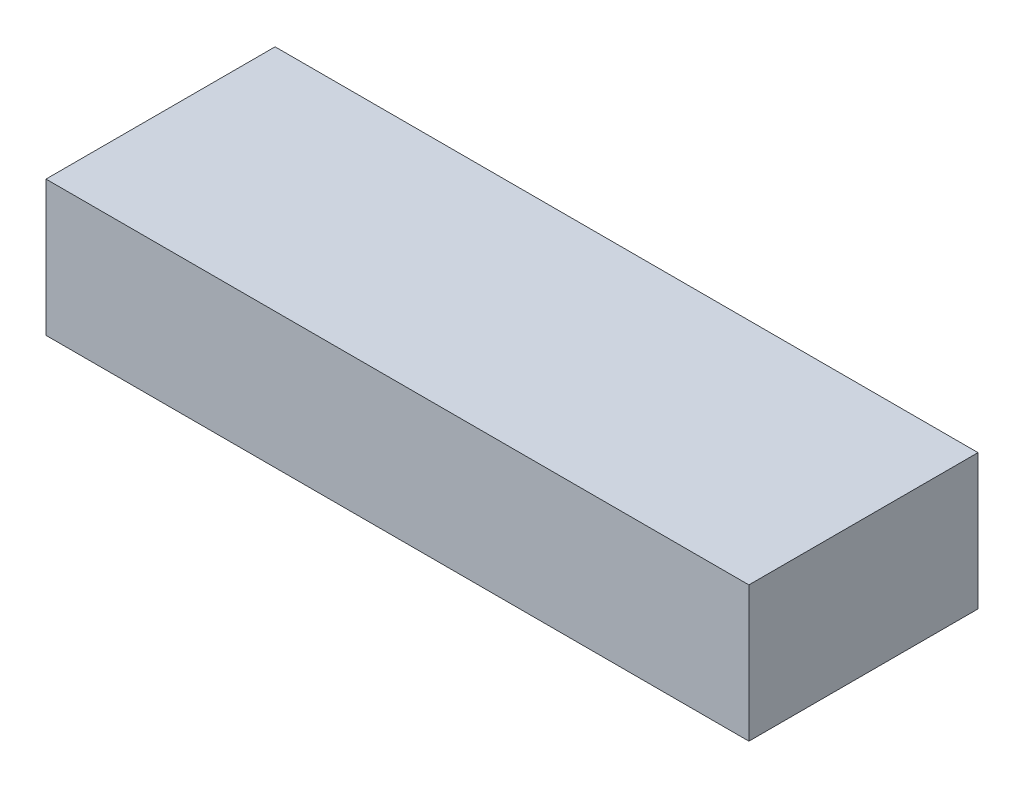
ISO-10303-21;
HEADER;
FILE_DESCRIPTION(('STEP AP214'),'2;1');
FILE_NAME('part.step','',(''),(''),'','','');
FILE_SCHEMA(('AUTOMOTIVE_DESIGN { 1 0 10303 214 1 1 1 1 }'));
ENDSEC;
DATA;
#1=APPLICATION_CONTEXT('core data for automotive mechanical design processes');
#2=APPLICATION_PROTOCOL_DEFINITION('international standard','automotive_design',2000,#1);
#3=PRODUCT_CONTEXT('',#1,'mechanical');
#4=PRODUCT('Part','Part','',(#3));
#5=PRODUCT_RELATED_PRODUCT_CATEGORY('part','',(#4));
#6=PRODUCT_DEFINITION_FORMATION('','',#4);
#7=PRODUCT_DEFINITION_CONTEXT('part definition',#1,'design');
#8=PRODUCT_DEFINITION('design','',#6,#7);
#9=PRODUCT_DEFINITION_SHAPE('','',#8);
#10=(LENGTH_UNIT() NAMED_UNIT(*) SI_UNIT(.MILLI.,.METRE.));
#11=(NAMED_UNIT(*) PLANE_ANGLE_UNIT() SI_UNIT($,.RADIAN.));
#12=(NAMED_UNIT(*) SI_UNIT($,.STERADIAN.) SOLID_ANGLE_UNIT());
#13=UNCERTAINTY_MEASURE_WITH_UNIT(LENGTH_MEASURE(1.E-05),#10,'distance_accuracy_value','');
#14=(GEOMETRIC_REPRESENTATION_CONTEXT(3) GLOBAL_UNCERTAINTY_ASSIGNED_CONTEXT((#13)) GLOBAL_UNIT_ASSIGNED_CONTEXT((#10,
#11,#12)) REPRESENTATION_CONTEXT('',''));
#15=CARTESIAN_POINT('',(0.,0.,0.));
#16=DIRECTION('',(0.,0.,1.));
#17=DIRECTION('',(1.,0.,0.));
#18=AXIS2_PLACEMENT_3D('',#15,#16,#17);
#19=CARTESIAN_POINT('',(0.,26.,0.));
#20=DIRECTION('',(1.,0.,0.));
#21=DIRECTION('',(0.,0.,1.));
#22=AXIS2_PLACEMENT_3D('',#19,#20,#21);
#23=PLANE('',#22);
#24=DIRECTION('',(0.,0.,-1.));
#25=VECTOR('',#24,1.);
#26=CARTESIAN_POINT('',(0.,0.,0.));
#27=LINE('',#26,#25);
#28=CARTESIAN_POINT('',(0.,0.,44.));
#29=VERTEX_POINT('',#28);
#30=CARTESIAN_POINT('',(0.,0.,0.));
#31=VERTEX_POINT('',#30);
#32=EDGE_CURVE('E102',#29,#31,#27,.T.);
#33=ORIENTED_EDGE('',*,*,#32,.F.);
#34=DIRECTION('',(0.,-1.,0.));
#35=VECTOR('',#34,1.);
#36=CARTESIAN_POINT('',(0.,26.,44.));
#37=LINE('',#36,#35);
#38=CARTESIAN_POINT('',(0.,26.,44.));
#39=VERTEX_POINT('',#38);
#40=EDGE_CURVE('E101',#39,#29,#37,.T.);
#41=ORIENTED_EDGE('',*,*,#40,.F.);
#42=DIRECTION('',(0.,0.,-1.));
#43=VECTOR('',#42,1.);
#44=CARTESIAN_POINT('',(0.,26.,0.));
#45=LINE('',#44,#43);
#46=CARTESIAN_POINT('',(0.,26.,0.));
#47=VERTEX_POINT('',#46);
#48=EDGE_CURVE('E96',#39,#47,#45,.T.);
#49=ORIENTED_EDGE('',*,*,#48,.T.);
#50=DIRECTION('',(0.,-1.,0.));
#51=VECTOR('',#50,1.);
#52=CARTESIAN_POINT('',(0.,26.,0.));
#53=LINE('',#52,#51);
#54=EDGE_CURVE('E11',#47,#31,#53,.T.);
#55=ORIENTED_EDGE('',*,*,#54,.T.);
#56=EDGE_LOOP('',(#33,#41,#49,#55));
#57=FACE_BOUND('',#56,.T.);
#58=ADVANCED_FACE('F39',(#57),#23,.F.);
#59=CARTESIAN_POINT('',(0.,26.,0.));
#60=DIRECTION('',(0.,0.,1.));
#61=DIRECTION('',(-1.,0.,0.));
#62=AXIS2_PLACEMENT_3D('',#59,#60,#61);
#63=PLANE('',#62);
#64=DIRECTION('',(1.,0.,0.));
#65=VECTOR('',#64,1.);
#66=CARTESIAN_POINT('',(0.,0.,0.));
#67=LINE('',#66,#65);
#68=CARTESIAN_POINT('',(135.,0.,0.));
#69=VERTEX_POINT('',#68);
#70=EDGE_CURVE('E104',#31,#69,#67,.T.);
#71=ORIENTED_EDGE('',*,*,#70,.F.);
#72=ORIENTED_EDGE('',*,*,#54,.F.);
#73=DIRECTION('',(1.,0.,0.));
#74=VECTOR('',#73,1.);
#75=CARTESIAN_POINT('',(0.,26.,0.));
#76=LINE('',#75,#74);
#77=CARTESIAN_POINT('',(135.,26.,0.));
#78=VERTEX_POINT('',#77);
#79=EDGE_CURVE('E80',#47,#78,#76,.T.);
#80=ORIENTED_EDGE('',*,*,#79,.T.);
#81=DIRECTION('',(0.,-1.,0.));
#82=VECTOR('',#81,1.);
#83=CARTESIAN_POINT('',(135.,26.,0.));
#84=LINE('',#83,#82);
#85=EDGE_CURVE('E47',#78,#69,#84,.T.);
#86=ORIENTED_EDGE('',*,*,#85,.T.);
#87=EDGE_LOOP('',(#71,#72,#80,#86));
#88=FACE_BOUND('',#87,.T.);
#89=ADVANCED_FACE('F94',(#88),#63,.F.);
#90=CARTESIAN_POINT('',(135.,26.,0.));
#91=DIRECTION('',(-1.,0.,0.));
#92=DIRECTION('',(0.,0.,-1.));
#93=AXIS2_PLACEMENT_3D('',#90,#91,#92);
#94=PLANE('',#93);
#95=DIRECTION('',(0.,0.,1.));
#96=VECTOR('',#95,1.);
#97=CARTESIAN_POINT('',(135.,0.,0.));
#98=LINE('',#97,#96);
#99=CARTESIAN_POINT('',(135.,0.,44.));
#100=VERTEX_POINT('',#99);
#101=EDGE_CURVE('E90',#69,#100,#98,.T.);
#102=ORIENTED_EDGE('',*,*,#101,.F.);
#103=ORIENTED_EDGE('',*,*,#85,.F.);
#104=DIRECTION('',(0.,0.,1.));
#105=VECTOR('',#104,1.);
#106=CARTESIAN_POINT('',(135.,26.,0.));
#107=LINE('',#106,#105);
#108=CARTESIAN_POINT('',(135.,26.,44.));
#109=VERTEX_POINT('',#108);
#110=EDGE_CURVE('E83',#78,#109,#107,.T.);
#111=ORIENTED_EDGE('',*,*,#110,.T.);
#112=DIRECTION('',(0.,-1.,0.));
#113=VECTOR('',#112,1.);
#114=CARTESIAN_POINT('',(135.,26.,44.));
#115=LINE('',#114,#113);
#116=EDGE_CURVE('E93',#109,#100,#115,.T.);
#117=ORIENTED_EDGE('',*,*,#116,.T.);
#118=EDGE_LOOP('',(#102,#103,#111,#117));
#119=FACE_BOUND('',#118,.T.);
#120=ADVANCED_FACE('F89',(#119),#94,.F.);
#121=CARTESIAN_POINT('',(0.,26.,44.));
#122=DIRECTION('',(0.,0.,-1.));
#123=DIRECTION('',(1.,0.,0.));
#124=AXIS2_PLACEMENT_3D('',#121,#122,#123);
#125=PLANE('',#124);
#126=DIRECTION('',(-1.,0.,0.));
#127=VECTOR('',#126,1.);
#128=CARTESIAN_POINT('',(0.,0.,44.));
#129=LINE('',#128,#127);
#130=EDGE_CURVE('E69',#100,#29,#129,.T.);
#131=ORIENTED_EDGE('',*,*,#130,.F.);
#132=ORIENTED_EDGE('',*,*,#116,.F.);
#133=DIRECTION('',(-1.,0.,0.));
#134=VECTOR('',#133,1.);
#135=CARTESIAN_POINT('',(0.,26.,44.));
#136=LINE('',#135,#134);
#137=EDGE_CURVE('E55',#109,#39,#136,.T.);
#138=ORIENTED_EDGE('',*,*,#137,.T.);
#139=ORIENTED_EDGE('',*,*,#40,.T.);
#140=EDGE_LOOP('',(#131,#132,#138,#139));
#141=FACE_BOUND('',#140,.T.);
#142=ADVANCED_FACE('F113',(#141),#125,.F.);
#143=CARTESIAN_POINT('',(0.,26.,0.));
#144=DIRECTION('',(0.,-1.,0.));
#145=DIRECTION('',(0.,0.,1.));
#146=AXIS2_PLACEMENT_3D('',#143,#144,#145);
#147=PLANE('',#146);
#148=ORIENTED_EDGE('',*,*,#48,.F.);
#149=ORIENTED_EDGE('',*,*,#137,.F.);
#150=ORIENTED_EDGE('',*,*,#110,.F.);
#151=ORIENTED_EDGE('',*,*,#79,.F.);
#152=EDGE_LOOP('',(#148,#149,#150,#151));
#153=FACE_BOUND('',#152,.T.);
#154=ADVANCED_FACE('F85',(#153),#147,.F.);
#155=CARTESIAN_POINT('',(0.,0.,0.));
#156=DIRECTION('',(0.,-1.,0.));
#157=DIRECTION('',(0.,0.,1.));
#158=AXIS2_PLACEMENT_3D('',#155,#156,#157);
#159=PLANE('',#158);
#160=ORIENTED_EDGE('',*,*,#32,.T.);
#161=ORIENTED_EDGE('',*,*,#70,.T.);
#162=ORIENTED_EDGE('',*,*,#101,.T.);
#163=ORIENTED_EDGE('',*,*,#130,.T.);
#164=EDGE_LOOP('',(#160,#161,#162,#163));
#165=FACE_BOUND('',#164,.T.);
#166=ADVANCED_FACE('F109',(#165),#159,.T.);
#167=CLOSED_SHELL('',(#58,#89,#120,#142,#154,#166));
#168=MANIFOLD_SOLID_BREP('B2',#167);
#169=ADVANCED_BREP_SHAPE_REPRESENTATION('',(#18,#168),#14);
#170=SHAPE_DEFINITION_REPRESENTATION(#9,#169);
ENDSEC;
END-ISO-10303-21;
